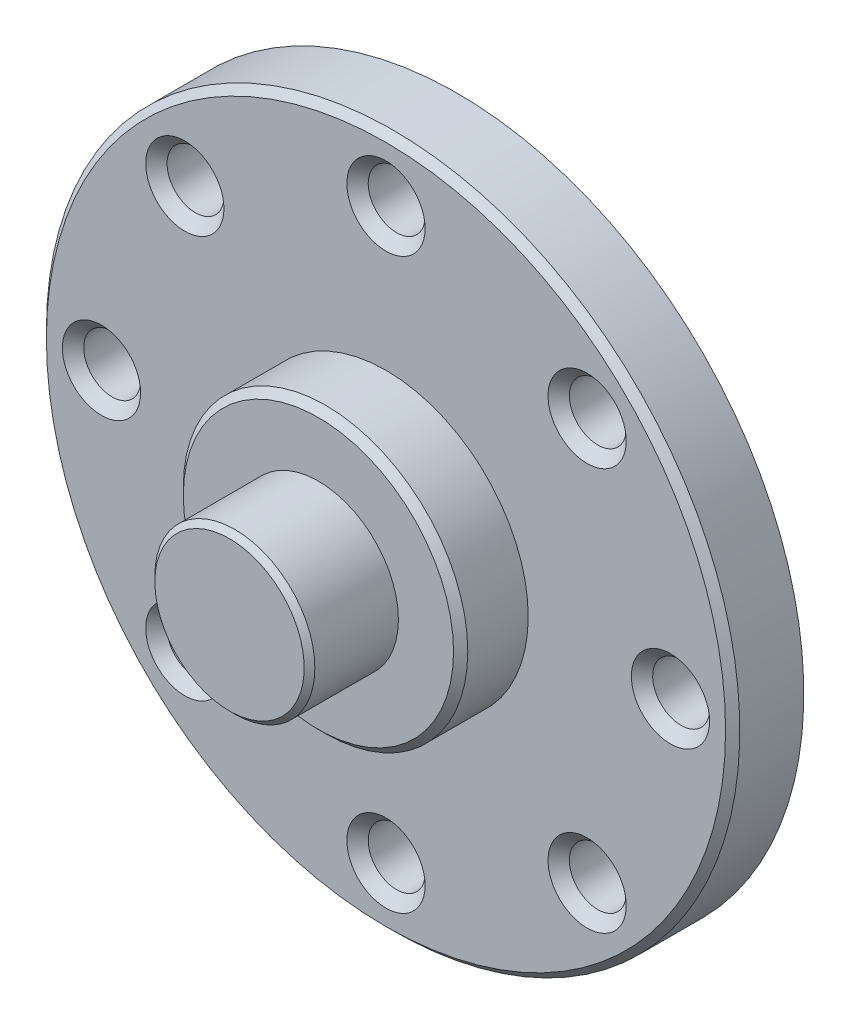
ISO-10303-21;
HEADER;
FILE_DESCRIPTION(('STEP AP214'),'2;1');
FILE_NAME('part.step','',(''),(''),'','','');
FILE_SCHEMA(('AUTOMOTIVE_DESIGN { 1 0 10303 214 1 1 1 1 }'));
ENDSEC;
DATA;
#1=APPLICATION_CONTEXT('core data for automotive mechanical design processes');
#2=APPLICATION_PROTOCOL_DEFINITION('international standard','automotive_design',2000,#1);
#3=PRODUCT_CONTEXT('',#1,'mechanical');
#4=PRODUCT('Part','Part','',(#3));
#5=PRODUCT_RELATED_PRODUCT_CATEGORY('part','',(#4));
#6=PRODUCT_DEFINITION_FORMATION('','',#4);
#7=PRODUCT_DEFINITION_CONTEXT('part definition',#1,'design');
#8=PRODUCT_DEFINITION('design','',#6,#7);
#9=PRODUCT_DEFINITION_SHAPE('','',#8);
#10=(LENGTH_UNIT() NAMED_UNIT(*) SI_UNIT(.MILLI.,.METRE.));
#11=(NAMED_UNIT(*) PLANE_ANGLE_UNIT() SI_UNIT($,.RADIAN.));
#12=(NAMED_UNIT(*) SI_UNIT($,.STERADIAN.) SOLID_ANGLE_UNIT());
#13=UNCERTAINTY_MEASURE_WITH_UNIT(LENGTH_MEASURE(1.E-05),#10,'distance_accuracy_value','');
#14=(GEOMETRIC_REPRESENTATION_CONTEXT(3) GLOBAL_UNCERTAINTY_ASSIGNED_CONTEXT((#13)) GLOBAL_UNIT_ASSIGNED_CONTEXT((#10,
#11,#12)) REPRESENTATION_CONTEXT('',''));
#15=CARTESIAN_POINT('',(0.,0.,0.));
#16=DIRECTION('',(0.,0.,1.));
#17=DIRECTION('',(1.,0.,0.));
#18=AXIS2_PLACEMENT_3D('',#15,#16,#17);
#19=CARTESIAN_POINT('',(12.0843145750494,10.8499999999994,16.9999999999992));
#20=DIRECTION('',(0.,0.,1.));
#21=DIRECTION('',(1.,0.,0.));
#22=AXIS2_PLACEMENT_3D('',#19,#20,#21);
#23=PLANE('',#22);
#24=CARTESIAN_POINT('',(-5.656854249492,5.656854249492,17.));
#25=DIRECTION('',(0.,0.,1.));
#26=DIRECTION('',(1.,0.,0.));
#27=AXIS2_PLACEMENT_3D('',#24,#25,#26);
#28=CIRCLE('',#27,0.8);
#29=CARTESIAN_POINT('',(-4.856854249492,5.656854249492,17.));
#30=VERTEX_POINT('',#29);
#31=EDGE_CURVE('E113',#30,#30,#28,.T.);
#32=ORIENTED_EDGE('',*,*,#31,.T.);
#33=EDGE_LOOP('',(#32));
#34=FACE_BOUND('',#33,.T.);
#35=CARTESIAN_POINT('',(-5.656854249492,-5.656854249492,17.));
#36=DIRECTION('',(0.,0.,1.));
#37=DIRECTION('',(1.,0.,0.));
#38=AXIS2_PLACEMENT_3D('',#35,#36,#37);
#39=CIRCLE('',#38,0.8);
#40=CARTESIAN_POINT('',(-4.856854249492,-5.656854249492,17.));
#41=VERTEX_POINT('',#40);
#42=EDGE_CURVE('E119',#41,#41,#39,.T.);
#43=ORIENTED_EDGE('',*,*,#42,.T.);
#44=EDGE_LOOP('',(#43));
#45=FACE_BOUND('',#44,.T.);
#46=CARTESIAN_POINT('',(5.656854249492,-5.656854249492,17.));
#47=DIRECTION('',(0.,0.,1.));
#48=DIRECTION('',(1.,0.,0.));
#49=AXIS2_PLACEMENT_3D('',#46,#47,#48);
#50=CIRCLE('',#49,0.8);
#51=CARTESIAN_POINT('',(6.456854249492,-5.656854249492,17.));
#52=VERTEX_POINT('',#51);
#53=EDGE_CURVE('E125',#52,#52,#50,.T.);
#54=ORIENTED_EDGE('',*,*,#53,.T.);
#55=EDGE_LOOP('',(#54));
#56=FACE_BOUND('',#55,.T.);
#57=CARTESIAN_POINT('',(5.656854249492,5.656854249492,17.));
#58=DIRECTION('',(0.,0.,1.));
#59=DIRECTION('',(1.,0.,0.));
#60=AXIS2_PLACEMENT_3D('',#57,#58,#59);
#61=CIRCLE('',#60,0.8);
#62=CARTESIAN_POINT('',(6.456854249492,5.656854249492,17.));
#63=VERTEX_POINT('',#62);
#64=EDGE_CURVE('E130',#63,#63,#61,.T.);
#65=ORIENTED_EDGE('',*,*,#64,.T.);
#66=EDGE_LOOP('',(#65));
#67=FACE_BOUND('',#66,.T.);
#68=CARTESIAN_POINT('',(0.,0.,17.));
#69=DIRECTION('',(0.,0.,-1.));
#70=DIRECTION('',(-1.,0.,0.));
#71=AXIS2_PLACEMENT_3D('',#68,#69,#70);
#72=CIRCLE('',#71,9.75);
#73=CARTESIAN_POINT('',(-9.75,0.,17.));
#74=VERTEX_POINT('',#73);
#75=EDGE_CURVE('E33',#74,#74,#72,.T.);
#76=ORIENTED_EDGE('',*,*,#75,.T.);
#77=EDGE_LOOP('',(#76));
#78=FACE_BOUND('',#77,.T.);
#79=CARTESIAN_POINT('',(8.,0.,17.));
#80=DIRECTION('',(0.,0.,1.));
#81=DIRECTION('',(1.,0.,0.));
#82=AXIS2_PLACEMENT_3D('',#79,#80,#81);
#83=CIRCLE('',#82,0.8);
#84=CARTESIAN_POINT('',(8.8,0.,17.));
#85=VERTEX_POINT('',#84);
#86=EDGE_CURVE('E128',#85,#85,#83,.T.);
#87=ORIENTED_EDGE('',*,*,#86,.T.);
#88=EDGE_LOOP('',(#87));
#89=FACE_BOUND('',#88,.T.);
#90=CARTESIAN_POINT('',(0.,-8.,17.));
#91=DIRECTION('',(0.,0.,1.));
#92=DIRECTION('',(1.,0.,0.));
#93=AXIS2_PLACEMENT_3D('',#90,#91,#92);
#94=CIRCLE('',#93,0.8);
#95=CARTESIAN_POINT('',(0.8,-8.,17.));
#96=VERTEX_POINT('',#95);
#97=EDGE_CURVE('E122',#96,#96,#94,.T.);
#98=ORIENTED_EDGE('',*,*,#97,.T.);
#99=EDGE_LOOP('',(#98));
#100=FACE_BOUND('',#99,.T.);
#101=CARTESIAN_POINT('',(-8.,0.,17.));
#102=DIRECTION('',(0.,0.,1.));
#103=DIRECTION('',(1.,0.,0.));
#104=AXIS2_PLACEMENT_3D('',#101,#102,#103);
#105=CIRCLE('',#104,0.8);
#106=CARTESIAN_POINT('',(-7.2,0.,17.));
#107=VERTEX_POINT('',#106);
#108=EDGE_CURVE('E116',#107,#107,#105,.T.);
#109=ORIENTED_EDGE('',*,*,#108,.T.);
#110=EDGE_LOOP('',(#109));
#111=FACE_BOUND('',#110,.T.);
#112=CARTESIAN_POINT('',(0.,8.,17.));
#113=DIRECTION('',(0.,0.,1.));
#114=DIRECTION('',(1.,0.,0.));
#115=AXIS2_PLACEMENT_3D('',#112,#113,#114);
#116=CIRCLE('',#115,0.8);
#117=CARTESIAN_POINT('',(0.8,8.,17.));
#118=VERTEX_POINT('',#117);
#119=EDGE_CURVE('E110',#118,#118,#116,.T.);
#120=ORIENTED_EDGE('',*,*,#119,.T.);
#121=EDGE_LOOP('',(#120));
#122=FACE_BOUND('',#121,.T.);
#123=ADVANCED_FACE('F30',(#34,#45,#56,#67,#78,#89,#100,#111,#122),#23,.F.);
#124=CARTESIAN_POINT('',(0.,0.,23.4));
#125=DIRECTION('',(0.,0.,1.));
#126=DIRECTION('',(1.,0.,0.));
#127=AXIS2_PLACEMENT_3D('',#124,#125,#126);
#128=PLANE('',#127);
#129=CARTESIAN_POINT('',(0.,0.,23.399999999981));
#130=DIRECTION('',(0.,0.,-1.));
#131=DIRECTION('',(-1.,0.,0.));
#132=AXIS2_PLACEMENT_3D('',#129,#130,#131);
#133=CIRCLE('',#132,2.10000000004129);
#134=CARTESIAN_POINT('',(-2.10000000004129,0.,23.399999999981));
#135=VERTEX_POINT('',#134);
#136=EDGE_CURVE('E10',#135,#135,#133,.T.);
#137=ORIENTED_EDGE('',*,*,#136,.F.);
#138=EDGE_LOOP('',(#137));
#139=FACE_BOUND('',#138,.T.);
#140=ADVANCED_FACE('F165',(#139),#128,.T.);
#141=CARTESIAN_POINT('',(0.,0.,23.2500000000186));
#142=DIRECTION('',(0.,0.,-1.));
#143=DIRECTION('',(-1.,0.,0.));
#144=AXIS2_PLACEMENT_3D('',#141,#142,#143);
#145=CONICAL_SURFACE('',#144,2.25000000006048,0.785398163586926);
#146=CARTESIAN_POINT('',(0.,0.,23.25));
#147=DIRECTION('',(0.,0.,1.));
#148=DIRECTION('',(1.,0.,0.));
#149=AXIS2_PLACEMENT_3D('',#146,#147,#148);
#150=CIRCLE('',#149,2.25);
#151=CARTESIAN_POINT('',(2.25,0.,23.25));
#152=VERTEX_POINT('',#151);
#153=EDGE_CURVE('E37',#152,#152,#150,.F.);
#154=ORIENTED_EDGE('',*,*,#153,.F.);
#155=EDGE_LOOP('',(#154));
#156=FACE_BOUND('',#155,.T.);
#157=ORIENTED_EDGE('',*,*,#136,.T.);
#158=EDGE_LOOP('',(#157));
#159=FACE_BOUND('',#158,.T.);
#160=ADVANCED_FACE('F171',(#156,#159),#145,.T.);
#161=CARTESIAN_POINT('',(0.,0.,20.9));
#162=DIRECTION('',(0.,0.,1.));
#163=DIRECTION('',(1.,0.,0.));
#164=AXIS2_PLACEMENT_3D('',#161,#162,#163);
#165=CYLINDRICAL_SURFACE('',#164,2.25);
#166=CARTESIAN_POINT('',(0.,0.,20.9));
#167=DIRECTION('',(0.,0.,1.));
#168=DIRECTION('',(1.,0.,0.));
#169=AXIS2_PLACEMENT_3D('',#166,#167,#168);
#170=CIRCLE('',#169,2.25);
#171=CARTESIAN_POINT('',(2.25,0.,20.9));
#172=VERTEX_POINT('',#171);
#173=EDGE_CURVE('E42',#172,#172,#170,.T.);
#174=ORIENTED_EDGE('',*,*,#173,.T.);
#175=EDGE_LOOP('',(#174));
#176=FACE_BOUND('',#175,.T.);
#177=ORIENTED_EDGE('',*,*,#153,.T.);
#178=EDGE_LOOP('',(#177));
#179=FACE_BOUND('',#178,.T.);
#180=ADVANCED_FACE('F369',(#176,#179),#165,.T.);
#181=CARTESIAN_POINT('',(0.,0.,20.9));
#182=DIRECTION('',(0.,0.,-1.));
#183=DIRECTION('',(-1.,0.,0.));
#184=AXIS2_PLACEMENT_3D('',#181,#182,#183);
#185=PLANE('',#184);
#186=ORIENTED_EDGE('',*,*,#173,.F.);
#187=EDGE_LOOP('',(#186));
#188=FACE_BOUND('',#187,.T.);
#189=CARTESIAN_POINT('',(0.,0.,20.8999999999833));
#190=DIRECTION('',(0.,0.,-1.));
#191=DIRECTION('',(-1.,0.,0.));
#192=AXIS2_PLACEMENT_3D('',#189,#190,#191);
#193=CIRCLE('',#192,3.79999999995562);
#194=CARTESIAN_POINT('',(-3.79999999995562,0.,20.8999999999833));
#195=VERTEX_POINT('',#194);
#196=EDGE_CURVE('E47',#195,#195,#193,.T.);
#197=ORIENTED_EDGE('',*,*,#196,.F.);
#198=EDGE_LOOP('',(#197));
#199=FACE_BOUND('',#198,.T.);
#200=ADVANCED_FACE('F209',(#188,#199),#185,.F.);
#201=CARTESIAN_POINT('',(0.,0.,20.7000000000903));
#202=DIRECTION('',(0.,0.,-1.));
#203=DIRECTION('',(-1.,0.,0.));
#204=AXIS2_PLACEMENT_3D('',#201,#202,#203);
#205=CONICAL_SURFACE('',#204,3.99999999984857,0.785398163397448);
#206=CARTESIAN_POINT('',(0.,0.,20.7));
#207=DIRECTION('',(0.,0.,-1.));
#208=DIRECTION('',(-1.,0.,0.));
#209=AXIS2_PLACEMENT_3D('',#206,#207,#208);
#210=CIRCLE('',#209,4.);
#211=CARTESIAN_POINT('',(-4.,0.,20.7));
#212=VERTEX_POINT('',#211);
#213=EDGE_CURVE('E54',#212,#212,#210,.T.);
#214=ORIENTED_EDGE('',*,*,#213,.F.);
#215=EDGE_LOOP('',(#214));
#216=FACE_BOUND('',#215,.T.);
#217=ORIENTED_EDGE('',*,*,#196,.T.);
#218=EDGE_LOOP('',(#217));
#219=FACE_BOUND('',#218,.T.);
#220=ADVANCED_FACE('F159',(#216,#219),#205,.T.);
#221=CARTESIAN_POINT('',(0.,0.,21.35));
#222=DIRECTION('',(0.,0.,-1.));
#223=DIRECTION('',(-1.,0.,0.));
#224=AXIS2_PLACEMENT_3D('',#221,#222,#223);
#225=CYLINDRICAL_SURFACE('',#224,4.);
#226=CARTESIAN_POINT('',(0.,0.,19.));
#227=DIRECTION('',(0.,0.,-1.));
#228=DIRECTION('',(-1.,0.,0.));
#229=AXIS2_PLACEMENT_3D('',#226,#227,#228);
#230=CIRCLE('',#229,4.);
#231=CARTESIAN_POINT('',(-4.,0.,19.));
#232=VERTEX_POINT('',#231);
#233=EDGE_CURVE('E76',#232,#232,#230,.F.);
#234=ORIENTED_EDGE('',*,*,#233,.T.);
#235=EDGE_LOOP('',(#234));
#236=FACE_BOUND('',#235,.T.);
#237=ORIENTED_EDGE('',*,*,#213,.T.);
#238=EDGE_LOOP('',(#237));
#239=FACE_BOUND('',#238,.T.);
#240=ADVANCED_FACE('F153',(#236,#239),#225,.T.);
#241=CARTESIAN_POINT('',(0.,0.,19.));
#242=DIRECTION('',(0.,0.,-1.));
#243=DIRECTION('',(-1.,0.,0.));
#244=AXIS2_PLACEMENT_3D('',#241,#242,#243);
#245=PLANE('',#244);
#246=ORIENTED_EDGE('',*,*,#233,.F.);
#247=EDGE_LOOP('',(#246));
#248=FACE_BOUND('',#247,.T.);
#249=CARTESIAN_POINT('',(5.656854249492,5.656854249492,18.9999999999486));
#250=DIRECTION('',(0.,0.,1.));
#251=DIRECTION('',(1.,0.,0.));
#252=AXIS2_PLACEMENT_3D('',#249,#250,#251);
#253=CIRCLE('',#252,1.09999999998456);
#254=CARTESIAN_POINT('',(6.75685424947656,5.656854249492,18.9999999999486));
#255=VERTEX_POINT('',#254);
#256=EDGE_CURVE('E73',#255,#255,#253,.T.);
#257=ORIENTED_EDGE('',*,*,#256,.F.);
#258=EDGE_LOOP('',(#257));
#259=FACE_BOUND('',#258,.T.);
#260=CARTESIAN_POINT('',(8.,0.,19.0000000000055));
#261=DIRECTION('',(0.,0.,1.));
#262=DIRECTION('',(1.,0.,0.));
#263=AXIS2_PLACEMENT_3D('',#260,#261,#262);
#264=CIRCLE('',#263,1.10000000000809);
#265=CARTESIAN_POINT('',(9.10000000000809,0.,19.0000000000055));
#266=VERTEX_POINT('',#265);
#267=EDGE_CURVE('E70',#266,#266,#264,.T.);
#268=ORIENTED_EDGE('',*,*,#267,.F.);
#269=EDGE_LOOP('',(#268));
#270=FACE_BOUND('',#269,.T.);
#271=CARTESIAN_POINT('',(5.656854249492,-5.656854249492,18.9999999999486));
#272=DIRECTION('',(0.,0.,1.));
#273=DIRECTION('',(1.,0.,0.));
#274=AXIS2_PLACEMENT_3D('',#271,#272,#273);
#275=CIRCLE('',#274,1.09999999998456);
#276=CARTESIAN_POINT('',(6.75685424947656,-5.656854249492,18.9999999999486));
#277=VERTEX_POINT('',#276);
#278=EDGE_CURVE('E67',#277,#277,#275,.T.);
#279=ORIENTED_EDGE('',*,*,#278,.F.);
#280=EDGE_LOOP('',(#279));
#281=FACE_BOUND('',#280,.T.);
#282=CARTESIAN_POINT('',(0.,-8.,19.0000000000055));
#283=DIRECTION('',(0.,0.,1.));
#284=DIRECTION('',(1.,0.,0.));
#285=AXIS2_PLACEMENT_3D('',#282,#283,#284);
#286=CIRCLE('',#285,1.10000000000809);
#287=CARTESIAN_POINT('',(1.10000000000809,-8.,19.0000000000055));
#288=VERTEX_POINT('',#287);
#289=EDGE_CURVE('E64',#288,#288,#286,.T.);
#290=ORIENTED_EDGE('',*,*,#289,.F.);
#291=EDGE_LOOP('',(#290));
#292=FACE_BOUND('',#291,.T.);
#293=CARTESIAN_POINT('',(-5.656854249492,-5.656854249492,18.9999999999486));
#294=DIRECTION('',(0.,0.,1.));
#295=DIRECTION('',(1.,0.,0.));
#296=AXIS2_PLACEMENT_3D('',#293,#294,#295);
#297=CIRCLE('',#296,1.09999999998456);
#298=CARTESIAN_POINT('',(-4.55685424950744,-5.656854249492,18.9999999999486));
#299=VERTEX_POINT('',#298);
#300=EDGE_CURVE('E61',#299,#299,#297,.T.);
#301=ORIENTED_EDGE('',*,*,#300,.F.);
#302=EDGE_LOOP('',(#301));
#303=FACE_BOUND('',#302,.T.);
#304=CARTESIAN_POINT('',(-8.,0.,19.0000000000055));
#305=DIRECTION('',(0.,0.,1.));
#306=DIRECTION('',(1.,0.,0.));
#307=AXIS2_PLACEMENT_3D('',#304,#305,#306);
#308=CIRCLE('',#307,1.10000000000809);
#309=CARTESIAN_POINT('',(-6.89999999999191,0.,19.0000000000055));
#310=VERTEX_POINT('',#309);
#311=EDGE_CURVE('E58',#310,#310,#308,.T.);
#312=ORIENTED_EDGE('',*,*,#311,.F.);
#313=EDGE_LOOP('',(#312));
#314=FACE_BOUND('',#313,.T.);
#315=CARTESIAN_POINT('',(-5.656854249492,5.656854249492,18.9999999999486));
#316=DIRECTION('',(0.,0.,1.));
#317=DIRECTION('',(1.,0.,0.));
#318=AXIS2_PLACEMENT_3D('',#315,#316,#317);
#319=CIRCLE('',#318,1.09999999998456);
#320=CARTESIAN_POINT('',(-4.55685424950744,5.656854249492,18.9999999999486));
#321=VERTEX_POINT('',#320);
#322=EDGE_CURVE('E55',#321,#321,#319,.T.);
#323=ORIENTED_EDGE('',*,*,#322,.F.);
#324=EDGE_LOOP('',(#323));
#325=FACE_BOUND('',#324,.T.);
#326=CARTESIAN_POINT('',(0.,8.,19.0000000000055));
#327=DIRECTION('',(0.,0.,1.));
#328=DIRECTION('',(1.,0.,0.));
#329=AXIS2_PLACEMENT_3D('',#326,#327,#328);
#330=CIRCLE('',#329,1.10000000000809);
#331=CARTESIAN_POINT('',(1.10000000000809,8.,19.0000000000055));
#332=VERTEX_POINT('',#331);
#333=EDGE_CURVE('E51',#332,#332,#330,.T.);
#334=ORIENTED_EDGE('',*,*,#333,.F.);
#335=EDGE_LOOP('',(#334));
#336=FACE_BOUND('',#335,.T.);
#337=CARTESIAN_POINT('',(0.,0.,19.));
#338=DIRECTION('',(0.,0.,-1.));
#339=DIRECTION('',(-1.,0.,0.));
#340=AXIS2_PLACEMENT_3D('',#337,#338,#339);
#341=CIRCLE('',#340,9.54999999999902);
#342=CARTESIAN_POINT('',(-9.54999999999902,0.,19.));
#343=VERTEX_POINT('',#342);
#344=EDGE_CURVE('E79',#343,#343,#341,.T.);
#345=ORIENTED_EDGE('',*,*,#344,.F.);
#346=EDGE_LOOP('',(#345));
#347=FACE_BOUND('',#346,.T.);
#348=ADVANCED_FACE('F148',(#248,#259,#270,#281,#292,#303,#314,#325,#336,#347),#245,.F.);
#349=CARTESIAN_POINT('',(0.,0.,18.8));
#350=DIRECTION('',(0.,0.,-1.));
#351=DIRECTION('',(-1.,0.,0.));
#352=AXIS2_PLACEMENT_3D('',#349,#350,#351);
#353=CONICAL_SURFACE('',#352,9.74999999999899,0.785398163397301);
#354=CARTESIAN_POINT('',(0.,0.,18.8));
#355=DIRECTION('',(0.,0.,-1.));
#356=DIRECTION('',(-1.,0.,0.));
#357=AXIS2_PLACEMENT_3D('',#354,#355,#356);
#358=CIRCLE('',#357,9.75);
#359=CARTESIAN_POINT('',(-9.75,0.,18.8));
#360=VERTEX_POINT('',#359);
#361=EDGE_CURVE('E81',#360,#360,#358,.T.);
#362=ORIENTED_EDGE('',*,*,#361,.F.);
#363=EDGE_LOOP('',(#362));
#364=FACE_BOUND('',#363,.T.);
#365=ORIENTED_EDGE('',*,*,#344,.T.);
#366=EDGE_LOOP('',(#365));
#367=FACE_BOUND('',#366,.T.);
#368=ADVANCED_FACE('F143',(#364,#367),#353,.T.);
#369=CARTESIAN_POINT('',(0.,0.,21.35));
#370=DIRECTION('',(0.,0.,-1.));
#371=DIRECTION('',(-1.,0.,0.));
#372=AXIS2_PLACEMENT_3D('',#369,#370,#371);
#373=CYLINDRICAL_SURFACE('',#372,9.75);
#374=ORIENTED_EDGE('',*,*,#75,.F.);
#375=EDGE_LOOP('',(#374));
#376=FACE_BOUND('',#375,.T.);
#377=ORIENTED_EDGE('',*,*,#361,.T.);
#378=EDGE_LOOP('',(#377));
#379=FACE_BOUND('',#378,.T.);
#380=ADVANCED_FACE('F139',(#376,#379),#373,.T.);
#381=CARTESIAN_POINT('',(5.656854249492,5.656854249492,18.9999999999486));
#382=DIRECTION('',(0.,0.,1.));
#383=DIRECTION('',(1.,0.,0.));
#384=AXIS2_PLACEMENT_3D('',#381,#382,#383);
#385=CONICAL_SURFACE('',#384,1.09999999998456,0.78539816337857);
#386=CARTESIAN_POINT('',(5.656854249492,5.656854249492,18.6999999999671));
#387=DIRECTION('',(0.,0.,1.));
#388=DIRECTION('',(-0.707106781165836,0.707106781207259,0.));
#389=AXIS2_PLACEMENT_3D('',#386,#387,#388);
#390=CIRCLE('',#389,0.800000000014348);
#391=CARTESIAN_POINT('',(5.09116882454919,6.22253967446795,18.6999999999671));
#392=VERTEX_POINT('',#391);
#393=EDGE_CURVE('E103',#392,#392,#390,.T.);
#394=ORIENTED_EDGE('',*,*,#393,.F.);
#395=EDGE_LOOP('',(#394));
#396=FACE_BOUND('',#395,.T.);
#397=ORIENTED_EDGE('',*,*,#256,.T.);
#398=EDGE_LOOP('',(#397));
#399=FACE_BOUND('',#398,.T.);
#400=ADVANCED_FACE('F142',(#396,#399),#385,.F.);
#401=CARTESIAN_POINT('',(5.656854249492,5.656854249492,16.39527708002));
#402=DIRECTION('',(0.,0.,1.));
#403=DIRECTION('',(1.,0.,0.));
#404=AXIS2_PLACEMENT_3D('',#401,#402,#403);
#405=CYLINDRICAL_SURFACE('',#404,0.8);
#406=ORIENTED_EDGE('',*,*,#393,.T.);
#407=EDGE_LOOP('',(#406));
#408=FACE_BOUND('',#407,.T.);
#409=ORIENTED_EDGE('',*,*,#64,.F.);
#410=EDGE_LOOP('',(#409));
#411=FACE_BOUND('',#410,.T.);
#412=ADVANCED_FACE('F203',(#408,#411),#405,.F.);
#413=CARTESIAN_POINT('',(8.,0.,18.9999999999486));
#414=DIRECTION('',(0.,0.,1.));
#415=DIRECTION('',(1.,0.,0.));
#416=AXIS2_PLACEMENT_3D('',#413,#414,#415);
#417=CONICAL_SURFACE('',#416,1.09999999995125,0.785398163397448);
#418=CARTESIAN_POINT('',(8.,0.,18.6999999999671));
#419=DIRECTION('',(0.,0.,1.));
#420=DIRECTION('',(0.,1.,0.));
#421=AXIS2_PLACEMENT_3D('',#418,#419,#420);
#422=CIRCLE('',#421,0.799999999969714);
#423=CARTESIAN_POINT('',(8.,0.799999999969714,18.6999999999671));
#424=VERTEX_POINT('',#423);
#425=EDGE_CURVE('E100',#424,#424,#422,.T.);
#426=ORIENTED_EDGE('',*,*,#425,.F.);
#427=EDGE_LOOP('',(#426));
#428=FACE_BOUND('',#427,.T.);
#429=ORIENTED_EDGE('',*,*,#267,.T.);
#430=EDGE_LOOP('',(#429));
#431=FACE_BOUND('',#430,.T.);
#432=ADVANCED_FACE('F201',(#428,#431),#417,.F.);
#433=CARTESIAN_POINT('',(8.,0.,16.39527708002));
#434=DIRECTION('',(0.,0.,1.));
#435=DIRECTION('',(1.,0.,0.));
#436=AXIS2_PLACEMENT_3D('',#433,#434,#435);
#437=CYLINDRICAL_SURFACE('',#436,0.8);
#438=ORIENTED_EDGE('',*,*,#425,.T.);
#439=EDGE_LOOP('',(#438));
#440=FACE_BOUND('',#439,.T.);
#441=ORIENTED_EDGE('',*,*,#86,.F.);
#442=EDGE_LOOP('',(#441));
#443=FACE_BOUND('',#442,.T.);
#444=ADVANCED_FACE('F193',(#440,#443),#437,.F.);
#445=CARTESIAN_POINT('',(5.656854249492,-5.656854249492,18.9999999999486));
#446=DIRECTION('',(0.,0.,1.));
#447=DIRECTION('',(1.,0.,0.));
#448=AXIS2_PLACEMENT_3D('',#445,#446,#447);
#449=CONICAL_SURFACE('',#448,1.09999999998456,0.78539816337857);
#450=CARTESIAN_POINT('',(5.656854249492,-5.656854249492,18.6999999999671));
#451=DIRECTION('',(0.,0.,1.));
#452=DIRECTION('',(0.707106781207259,0.707106781165836,0.));
#453=AXIS2_PLACEMENT_3D('',#450,#451,#452);
#454=CIRCLE('',#453,0.800000000014348);
#455=CARTESIAN_POINT('',(6.22253967446795,-5.09116882454919,18.6999999999671));
#456=VERTEX_POINT('',#455);
#457=EDGE_CURVE('E97',#456,#456,#454,.T.);
#458=ORIENTED_EDGE('',*,*,#457,.F.);
#459=EDGE_LOOP('',(#458));
#460=FACE_BOUND('',#459,.T.);
#461=ORIENTED_EDGE('',*,*,#278,.T.);
#462=EDGE_LOOP('',(#461));
#463=FACE_BOUND('',#462,.T.);
#464=ADVANCED_FACE('F183',(#460,#463),#449,.F.);
#465=CARTESIAN_POINT('',(5.656854249492,-5.656854249492,16.39527708002));
#466=DIRECTION('',(0.,0.,1.));
#467=DIRECTION('',(1.,0.,0.));
#468=AXIS2_PLACEMENT_3D('',#465,#466,#467);
#469=CYLINDRICAL_SURFACE('',#468,0.8);
#470=ORIENTED_EDGE('',*,*,#457,.T.);
#471=EDGE_LOOP('',(#470));
#472=FACE_BOUND('',#471,.T.);
#473=ORIENTED_EDGE('',*,*,#53,.F.);
#474=EDGE_LOOP('',(#473));
#475=FACE_BOUND('',#474,.T.);
#476=ADVANCED_FACE('F180',(#472,#475),#469,.F.);
#477=CARTESIAN_POINT('',(0.,-8.,18.9999999999486));
#478=DIRECTION('',(0.,0.,1.));
#479=DIRECTION('',(1.,0.,0.));
#480=AXIS2_PLACEMENT_3D('',#477,#478,#479);
#481=CONICAL_SURFACE('',#480,1.09999999995125,0.785398163397448);
#482=CARTESIAN_POINT('',(0.,-8.,18.6999999999671));
#483=DIRECTION('',(0.,0.,1.));
#484=DIRECTION('',(1.,0.,0.));
#485=AXIS2_PLACEMENT_3D('',#482,#483,#484);
#486=CIRCLE('',#485,0.799999999969714);
#487=CARTESIAN_POINT('',(0.799999999969714,-8.,18.6999999999671));
#488=VERTEX_POINT('',#487);
#489=EDGE_CURVE('E94',#488,#488,#486,.T.);
#490=ORIENTED_EDGE('',*,*,#489,.F.);
#491=EDGE_LOOP('',(#490));
#492=FACE_BOUND('',#491,.T.);
#493=ORIENTED_EDGE('',*,*,#289,.T.);
#494=EDGE_LOOP('',(#493));
#495=FACE_BOUND('',#494,.T.);
#496=ADVANCED_FACE('F182',(#492,#495),#481,.F.);
#497=CARTESIAN_POINT('',(0.,-8.,16.39527708002));
#498=DIRECTION('',(0.,0.,1.));
#499=DIRECTION('',(1.,0.,0.));
#500=AXIS2_PLACEMENT_3D('',#497,#498,#499);
#501=CYLINDRICAL_SURFACE('',#500,0.8);
#502=ORIENTED_EDGE('',*,*,#489,.T.);
#503=EDGE_LOOP('',(#502));
#504=FACE_BOUND('',#503,.T.);
#505=ORIENTED_EDGE('',*,*,#97,.F.);
#506=EDGE_LOOP('',(#505));
#507=FACE_BOUND('',#506,.T.);
#508=ADVANCED_FACE('F190',(#504,#507),#501,.F.);
#509=CARTESIAN_POINT('',(-5.656854249492,-5.656854249492,18.9999999999486));
#510=DIRECTION('',(0.,0.,1.));
#511=DIRECTION('',(1.,0.,0.));
#512=AXIS2_PLACEMENT_3D('',#509,#510,#511);
#513=CONICAL_SURFACE('',#512,1.09999999998456,0.78539816337857);
#514=CARTESIAN_POINT('',(-5.656854249492,-5.656854249492,18.6999999999671));
#515=DIRECTION('',(0.,0.,1.));
#516=DIRECTION('',(0.707106781165836,-0.707106781207259,0.));
#517=AXIS2_PLACEMENT_3D('',#514,#515,#516);
#518=CIRCLE('',#517,0.800000000014348);
#519=CARTESIAN_POINT('',(-5.09116882454919,-6.22253967446795,18.6999999999671));
#520=VERTEX_POINT('',#519);
#521=EDGE_CURVE('E91',#520,#520,#518,.T.);
#522=ORIENTED_EDGE('',*,*,#521,.F.);
#523=EDGE_LOOP('',(#522));
#524=FACE_BOUND('',#523,.T.);
#525=ORIENTED_EDGE('',*,*,#300,.T.);
#526=EDGE_LOOP('',(#525));
#527=FACE_BOUND('',#526,.T.);
#528=ADVANCED_FACE('F227',(#524,#527),#513,.F.);
#529=CARTESIAN_POINT('',(-5.656854249492,-5.656854249492,16.39527708002));
#530=DIRECTION('',(0.,0.,1.));
#531=DIRECTION('',(1.,0.,0.));
#532=AXIS2_PLACEMENT_3D('',#529,#530,#531);
#533=CYLINDRICAL_SURFACE('',#532,0.8);
#534=ORIENTED_EDGE('',*,*,#521,.T.);
#535=EDGE_LOOP('',(#534));
#536=FACE_BOUND('',#535,.T.);
#537=ORIENTED_EDGE('',*,*,#42,.F.);
#538=EDGE_LOOP('',(#537));
#539=FACE_BOUND('',#538,.T.);
#540=ADVANCED_FACE('F225',(#536,#539),#533,.F.);
#541=CARTESIAN_POINT('',(-8.,0.,18.9999999999486));
#542=DIRECTION('',(0.,0.,1.));
#543=DIRECTION('',(1.,0.,0.));
#544=AXIS2_PLACEMENT_3D('',#541,#542,#543);
#545=CONICAL_SURFACE('',#544,1.09999999995125,0.785398163397448);
#546=CARTESIAN_POINT('',(-8.,0.,18.6999999999671));
#547=DIRECTION('',(0.,0.,1.));
#548=DIRECTION('',(0.,-1.,0.));
#549=AXIS2_PLACEMENT_3D('',#546,#547,#548);
#550=CIRCLE('',#549,0.799999999969714);
#551=CARTESIAN_POINT('',(-8.,-0.799999999969714,18.6999999999671));
#552=VERTEX_POINT('',#551);
#553=EDGE_CURVE('E88',#552,#552,#550,.T.);
#554=ORIENTED_EDGE('',*,*,#553,.F.);
#555=EDGE_LOOP('',(#554));
#556=FACE_BOUND('',#555,.T.);
#557=ORIENTED_EDGE('',*,*,#311,.T.);
#558=EDGE_LOOP('',(#557));
#559=FACE_BOUND('',#558,.T.);
#560=ADVANCED_FACE('F222',(#556,#559),#545,.F.);
#561=CARTESIAN_POINT('',(-8.,0.,16.39527708002));
#562=DIRECTION('',(0.,0.,1.));
#563=DIRECTION('',(1.,0.,0.));
#564=AXIS2_PLACEMENT_3D('',#561,#562,#563);
#565=CYLINDRICAL_SURFACE('',#564,0.8);
#566=ORIENTED_EDGE('',*,*,#553,.T.);
#567=EDGE_LOOP('',(#566));
#568=FACE_BOUND('',#567,.T.);
#569=ORIENTED_EDGE('',*,*,#108,.F.);
#570=EDGE_LOOP('',(#569));
#571=FACE_BOUND('',#570,.T.);
#572=ADVANCED_FACE('F220',(#568,#571),#565,.F.);
#573=CARTESIAN_POINT('',(-5.656854249492,5.656854249492,18.9999999999486));
#574=DIRECTION('',(0.,0.,1.));
#575=DIRECTION('',(1.,0.,0.));
#576=AXIS2_PLACEMENT_3D('',#573,#574,#575);
#577=CONICAL_SURFACE('',#576,1.09999999998456,0.78539816337857);
#578=CARTESIAN_POINT('',(-5.656854249492,5.656854249492,18.6999999999671));
#579=DIRECTION('',(0.,0.,1.));
#580=DIRECTION('',(-0.707106781207259,-0.707106781165836,0.));
#581=AXIS2_PLACEMENT_3D('',#578,#579,#580);
#582=CIRCLE('',#581,0.800000000014348);
#583=CARTESIAN_POINT('',(-6.22253967446795,5.09116882454919,18.6999999999671));
#584=VERTEX_POINT('',#583);
#585=EDGE_CURVE('E85',#584,#584,#582,.T.);
#586=ORIENTED_EDGE('',*,*,#585,.F.);
#587=EDGE_LOOP('',(#586));
#588=FACE_BOUND('',#587,.T.);
#589=ORIENTED_EDGE('',*,*,#322,.T.);
#590=EDGE_LOOP('',(#589));
#591=FACE_BOUND('',#590,.T.);
#592=ADVANCED_FACE('F217',(#588,#591),#577,.F.);
#593=CARTESIAN_POINT('',(-5.656854249492,5.656854249492,16.39527708002));
#594=DIRECTION('',(0.,0.,1.));
#595=DIRECTION('',(1.,0.,0.));
#596=AXIS2_PLACEMENT_3D('',#593,#594,#595);
#597=CYLINDRICAL_SURFACE('',#596,0.8);
#598=ORIENTED_EDGE('',*,*,#585,.T.);
#599=EDGE_LOOP('',(#598));
#600=FACE_BOUND('',#599,.T.);
#601=ORIENTED_EDGE('',*,*,#31,.F.);
#602=EDGE_LOOP('',(#601));
#603=FACE_BOUND('',#602,.T.);
#604=ADVANCED_FACE('F215',(#600,#603),#597,.F.);
#605=CARTESIAN_POINT('',(0.,8.,18.9999999999486));
#606=DIRECTION('',(0.,0.,1.));
#607=DIRECTION('',(1.,0.,0.));
#608=AXIS2_PLACEMENT_3D('',#605,#606,#607);
#609=CONICAL_SURFACE('',#608,1.09999999995125,0.785398163397448);
#610=CARTESIAN_POINT('',(0.,8.,18.6999999999671));
#611=DIRECTION('',(0.,0.,1.));
#612=DIRECTION('',(-1.,0.,0.));
#613=AXIS2_PLACEMENT_3D('',#610,#611,#612);
#614=CIRCLE('',#613,0.799999999969714);
#615=CARTESIAN_POINT('',(-0.799999999969714,8.,18.6999999999671));
#616=VERTEX_POINT('',#615);
#617=EDGE_CURVE('E50',#616,#616,#614,.T.);
#618=ORIENTED_EDGE('',*,*,#617,.F.);
#619=EDGE_LOOP('',(#618));
#620=FACE_BOUND('',#619,.T.);
#621=ORIENTED_EDGE('',*,*,#333,.T.);
#622=EDGE_LOOP('',(#621));
#623=FACE_BOUND('',#622,.T.);
#624=ADVANCED_FACE('F211',(#620,#623),#609,.F.);
#625=CARTESIAN_POINT('',(0.,8.,16.39527708002));
#626=DIRECTION('',(0.,0.,1.));
#627=DIRECTION('',(1.,0.,0.));
#628=AXIS2_PLACEMENT_3D('',#625,#626,#627);
#629=CYLINDRICAL_SURFACE('',#628,0.8);
#630=ORIENTED_EDGE('',*,*,#617,.T.);
#631=EDGE_LOOP('',(#630));
#632=FACE_BOUND('',#631,.T.);
#633=ORIENTED_EDGE('',*,*,#119,.F.);
#634=EDGE_LOOP('',(#633));
#635=FACE_BOUND('',#634,.T.);
#636=ADVANCED_FACE('F214',(#632,#635),#629,.F.);
#637=CLOSED_SHELL('',(#123,#140,#160,#180,#200,#220,#240,#348,#368,#380,#400,#412,#432,#444,
#464,#476,#496,#508,#528,#540,#560,#572,#592,#604,#624,#636));
#638=MANIFOLD_SOLID_BREP('B2',#637);
#639=ADVANCED_BREP_SHAPE_REPRESENTATION('',(#18,#638),#14);
#640=SHAPE_DEFINITION_REPRESENTATION(#9,#639);
ENDSEC;
END-ISO-10303-21;
